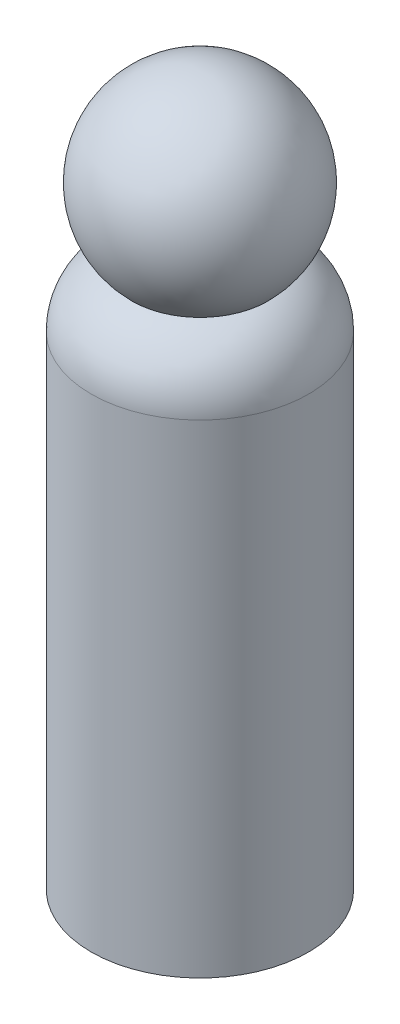
ISO-10303-21;
HEADER;
FILE_DESCRIPTION(('STEP AP214'),'2;1');
FILE_NAME('part.step','',(''),(''),'','','');
FILE_SCHEMA(('AUTOMOTIVE_DESIGN { 1 0 10303 214 1 1 1 1 }'));
ENDSEC;
DATA;
#1=APPLICATION_CONTEXT('core data for automotive mechanical design processes');
#2=APPLICATION_PROTOCOL_DEFINITION('international standard','automotive_design',2000,#1);
#3=PRODUCT_CONTEXT('',#1,'mechanical');
#4=PRODUCT('Part','Part','',(#3));
#5=PRODUCT_RELATED_PRODUCT_CATEGORY('part','',(#4));
#6=PRODUCT_DEFINITION_FORMATION('','',#4);
#7=PRODUCT_DEFINITION_CONTEXT('part definition',#1,'design');
#8=PRODUCT_DEFINITION('design','',#6,#7);
#9=PRODUCT_DEFINITION_SHAPE('','',#8);
#10=(LENGTH_UNIT() NAMED_UNIT(*) SI_UNIT(.MILLI.,.METRE.));
#11=(NAMED_UNIT(*) PLANE_ANGLE_UNIT() SI_UNIT($,.RADIAN.));
#12=(NAMED_UNIT(*) SI_UNIT($,.STERADIAN.) SOLID_ANGLE_UNIT());
#13=UNCERTAINTY_MEASURE_WITH_UNIT(LENGTH_MEASURE(1.E-05),#10,'distance_accuracy_value','');
#14=(GEOMETRIC_REPRESENTATION_CONTEXT(3) GLOBAL_UNCERTAINTY_ASSIGNED_CONTEXT((#13)) GLOBAL_UNIT_ASSIGNED_CONTEXT((#10,
#11,#12)) REPRESENTATION_CONTEXT('',''));
#15=CARTESIAN_POINT('',(0.,0.,0.));
#16=DIRECTION('',(0.,0.,1.));
#17=DIRECTION('',(1.,0.,0.));
#18=AXIS2_PLACEMENT_3D('',#15,#16,#17);
#19=CARTESIAN_POINT('',(0.,0.,0.));
#20=DIRECTION('',(0.,-1.,0.));
#21=DIRECTION('',(0.,0.,-1.));
#22=AXIS2_PLACEMENT_3D('',#19,#20,#21);
#23=PLANE('',#22);
#24=CARTESIAN_POINT('',(0.,0.,0.));
#25=DIRECTION('',(0.,1.,0.));
#26=DIRECTION('',(0.,0.,1.));
#27=AXIS2_PLACEMENT_3D('',#24,#25,#26);
#28=CIRCLE('',#27,21.43125);
#29=CARTESIAN_POINT('',(0.,0.,21.43125));
#30=VERTEX_POINT('',#29);
#31=EDGE_CURVE('E10',#30,#30,#28,.T.);
#32=ORIENTED_EDGE('',*,*,#31,.F.);
#33=EDGE_LOOP('',(#32));
#34=FACE_BOUND('',#33,.T.);
#35=ADVANCED_FACE('F32',(#34),#23,.T.);
#36=CARTESIAN_POINT('',(0.,139.7,0.));
#37=DIRECTION('',(0.,1.,0.));
#38=DIRECTION('',(0.,0.,1.));
#39=AXIS2_PLACEMENT_3D('',#36,#37,#38);
#40=CYLINDRICAL_SURFACE('',#39,21.43125);
#41=ORIENTED_EDGE('',*,*,#31,.T.);
#42=EDGE_LOOP('',(#41));
#43=FACE_BOUND('',#42,.T.);
#44=CARTESIAN_POINT('',(0.,95.25,0.));
#45=DIRECTION('',(0.,1.,0.));
#46=DIRECTION('',(0.,0.,1.));
#47=AXIS2_PLACEMENT_3D('',#44,#45,#46);
#48=CIRCLE('',#47,21.43125);
#49=CARTESIAN_POINT('',(0.,95.25,21.43125));
#50=VERTEX_POINT('',#49);
#51=EDGE_CURVE('E38',#50,#50,#48,.T.);
#52=ORIENTED_EDGE('',*,*,#51,.F.);
#53=EDGE_LOOP('',(#52));
#54=FACE_BOUND('',#53,.T.);
#55=ADVANCED_FACE('F53',(#43,#54),#40,.T.);
#56=CARTESIAN_POINT('',(0.,95.25,0.));
#57=DIRECTION('',(0.,1.,0.));
#58=DIRECTION('',(0.,0.,1.));
#59=AXIS2_PLACEMENT_3D('',#56,#57,#58);
#60=DEGENERATE_TOROIDAL_SURFACE('',#59,8.73125,12.7,.T.);
#61=ORIENTED_EDGE('',*,*,#51,.T.);
#62=EDGE_LOOP('',(#61));
#63=FACE_BOUND('',#62,.T.);
#64=CARTESIAN_POINT('',(0.,107.074643221739,0.));
#65=DIRECTION('',(0.,1.,0.));
#66=DIRECTION('',(0.,0.,1.));
#67=AXIS2_PLACEMENT_3D('',#64,#65,#66);
#68=CIRCLE('',#67,13.364587099605);
#69=CARTESIAN_POINT('',(0.,107.074643221739,13.364587099605));
#70=VERTEX_POINT('',#69);
#71=EDGE_CURVE('E42',#70,#70,#68,.T.);
#72=ORIENTED_EDGE('',*,*,#71,.F.);
#73=EDGE_LOOP('',(#72));
#74=FACE_BOUND('',#73,.T.);
#75=ADVANCED_FACE('F51',(#63,#74),#60,.T.);
#76=CARTESIAN_POINT('',(0.,120.65,0.));
#77=DIRECTION('',(0.,1.,0.));
#78=DIRECTION('',(1.,0.,0.));
#79=AXIS2_PLACEMENT_3D('',#76,#77,#78);
#80=SPHERICAL_SURFACE('',#79,19.05);
#81=ORIENTED_EDGE('',*,*,#71,.T.);
#82=EDGE_LOOP('',(#81));
#83=FACE_BOUND('',#82,.T.);
#84=ADVANCED_FACE('F49',(#83),#80,.T.);
#85=CLOSED_SHELL('',(#35,#55,#75,#84));
#86=MANIFOLD_SOLID_BREP('B2',#85);
#87=ADVANCED_BREP_SHAPE_REPRESENTATION('',(#18,#86),#14);
#88=SHAPE_DEFINITION_REPRESENTATION(#9,#87);
ENDSEC;
END-ISO-10303-21;
